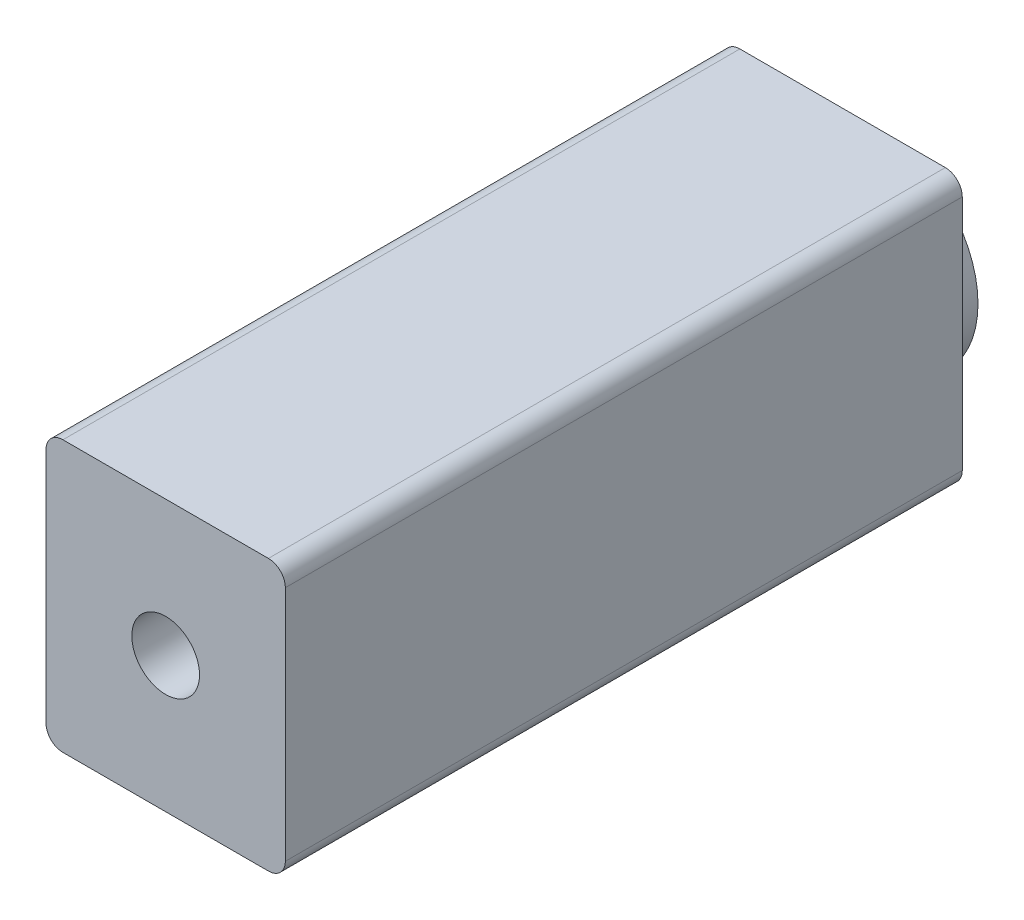
ISO-10303-21;
HEADER;
FILE_DESCRIPTION(('STEP AP214'),'2;1');
FILE_NAME('part.step','',(''),(''),'','','');
FILE_SCHEMA(('AUTOMOTIVE_DESIGN { 1 0 10303 214 1 1 1 1 }'));
ENDSEC;
DATA;
#1=APPLICATION_CONTEXT('core data for automotive mechanical design processes');
#2=APPLICATION_PROTOCOL_DEFINITION('international standard','automotive_design',2000,#1);
#3=PRODUCT_CONTEXT('',#1,'mechanical');
#4=PRODUCT('Part','Part','',(#3));
#5=PRODUCT_RELATED_PRODUCT_CATEGORY('part','',(#4));
#6=PRODUCT_DEFINITION_FORMATION('','',#4);
#7=PRODUCT_DEFINITION_CONTEXT('part definition',#1,'design');
#8=PRODUCT_DEFINITION('design','',#6,#7);
#9=PRODUCT_DEFINITION_SHAPE('','',#8);
#10=(LENGTH_UNIT() NAMED_UNIT(*) SI_UNIT(.MILLI.,.METRE.));
#11=(NAMED_UNIT(*) PLANE_ANGLE_UNIT() SI_UNIT($,.RADIAN.));
#12=(NAMED_UNIT(*) SI_UNIT($,.STERADIAN.) SOLID_ANGLE_UNIT());
#13=UNCERTAINTY_MEASURE_WITH_UNIT(LENGTH_MEASURE(1.E-05),#10,'distance_accuracy_value','');
#14=(GEOMETRIC_REPRESENTATION_CONTEXT(3) GLOBAL_UNCERTAINTY_ASSIGNED_CONTEXT((#13)) GLOBAL_UNIT_ASSIGNED_CONTEXT((#10,
#11,#12)) REPRESENTATION_CONTEXT('',''));
#15=CARTESIAN_POINT('',(0.,0.,0.));
#16=DIRECTION('',(0.,0.,1.));
#17=DIRECTION('',(1.,0.,0.));
#18=AXIS2_PLACEMENT_3D('',#15,#16,#17);
#19=CARTESIAN_POINT('',(0.,0.,10.));
#20=DIRECTION('',(0.,0.,-1.));
#21=DIRECTION('',(-1.,0.,0.));
#22=AXIS2_PLACEMENT_3D('',#19,#20,#21);
#23=CYLINDRICAL_SURFACE('',#22,30.);
#24=CARTESIAN_POINT('',(0.,0.,10.));
#25=DIRECTION('',(0.,0.,1.));
#26=DIRECTION('',(1.,0.,0.));
#27=AXIS2_PLACEMENT_3D('',#24,#25,#26);
#28=CIRCLE('',#27,30.);
#29=CARTESIAN_POINT('',(30.,0.,10.));
#30=VERTEX_POINT('',#29);
#31=EDGE_CURVE('E158',#30,#30,#28,.T.);
#32=ORIENTED_EDGE('',*,*,#31,.F.);
#33=EDGE_LOOP('',(#32));
#34=FACE_BOUND('',#33,.T.);
#35=CARTESIAN_POINT('',(0.,0.,0.));
#36=DIRECTION('',(0.,0.,1.));
#37=DIRECTION('',(1.,0.,0.));
#38=AXIS2_PLACEMENT_3D('',#35,#36,#37);
#39=CIRCLE('',#38,30.);
#40=CARTESIAN_POINT('',(30.,0.,0.));
#41=VERTEX_POINT('',#40);
#42=EDGE_CURVE('E225',#41,#41,#39,.T.);
#43=ORIENTED_EDGE('',*,*,#42,.T.);
#44=EDGE_LOOP('',(#43));
#45=FACE_BOUND('',#44,.T.);
#46=ADVANCED_FACE('F38',(#34,#45),#23,.T.);
#47=CARTESIAN_POINT('',(0.,0.,0.));
#48=DIRECTION('',(0.,0.,1.));
#49=DIRECTION('',(1.,0.,0.));
#50=AXIS2_PLACEMENT_3D('',#47,#48,#49);
#51=PLANE('',#50);
#52=ORIENTED_EDGE('',*,*,#42,.F.);
#53=EDGE_LOOP('',(#52));
#54=FACE_BOUND('',#53,.T.);
#55=ADVANCED_FACE('F337',(#54),#51,.F.);
#56=CARTESIAN_POINT('',(-35.3553390593273,-40.0000000000001,210.));
#57=DIRECTION('',(1.,0.,0.));
#58=DIRECTION('',(0.,0.,-1.));
#59=AXIS2_PLACEMENT_3D('',#56,#57,#58);
#60=PLANE('',#59);
#61=DIRECTION('',(0.,-1.,0.));
#62=VECTOR('',#61,1.);
#63=CARTESIAN_POINT('',(-35.3553390593273,-40.0000000000001,210.));
#64=LINE('',#63,#62);
#65=CARTESIAN_POINT('',(-35.3553390593273,35.0000000000001,210.));
#66=VERTEX_POINT('',#65);
#67=CARTESIAN_POINT('',(-35.3553390593273,-35.0000000000001,210.));
#68=VERTEX_POINT('',#67);
#69=EDGE_CURVE('E199',#66,#68,#64,.T.);
#70=ORIENTED_EDGE('',*,*,#69,.F.);
#71=DIRECTION('',(0.,0.,-1.));
#72=VECTOR('',#71,1.);
#73=CARTESIAN_POINT('',(-35.3553390593273,35.0000000000001,210.));
#74=LINE('',#73,#72);
#75=CARTESIAN_POINT('',(-35.3553390593273,35.0000000000001,10.));
#76=VERTEX_POINT('',#75);
#77=EDGE_CURVE('E189',#66,#76,#74,.T.);
#78=ORIENTED_EDGE('',*,*,#77,.T.);
#79=DIRECTION('',(0.,-1.,0.));
#80=VECTOR('',#79,1.);
#81=CARTESIAN_POINT('',(-35.3553390593273,-40.0000000000001,10.));
#82=LINE('',#81,#80);
#83=CARTESIAN_POINT('',(-35.3553390593273,-35.0000000000001,10.));
#84=VERTEX_POINT('',#83);
#85=EDGE_CURVE('E197',#76,#84,#82,.T.);
#86=ORIENTED_EDGE('',*,*,#85,.T.);
#87=DIRECTION('',(0.,0.,-1.));
#88=VECTOR('',#87,1.);
#89=CARTESIAN_POINT('',(-35.3553390593273,-35.0000000000001,210.));
#90=LINE('',#89,#88);
#91=EDGE_CURVE('E187',#84,#68,#90,.F.);
#92=ORIENTED_EDGE('',*,*,#91,.T.);
#93=EDGE_LOOP('',(#70,#78,#86,#92));
#94=FACE_BOUND('',#93,.T.);
#95=ADVANCED_FACE('F196',(#94),#60,.F.);
#96=CARTESIAN_POINT('',(35.3553390593273,-40.0000000000001,210.));
#97=DIRECTION('',(0.,1.,0.));
#98=DIRECTION('',(0.,0.,1.));
#99=AXIS2_PLACEMENT_3D('',#96,#97,#98);
#100=PLANE('',#99);
#101=DIRECTION('',(1.,0.,0.));
#102=VECTOR('',#101,1.);
#103=CARTESIAN_POINT('',(35.3553390593273,-40.0000000000001,210.));
#104=LINE('',#103,#102);
#105=CARTESIAN_POINT('',(-30.3553390593273,-40.0000000000001,210.));
#106=VERTEX_POINT('',#105);
#107=CARTESIAN_POINT('',(30.3553390593273,-40.0000000000001,210.));
#108=VERTEX_POINT('',#107);
#109=EDGE_CURVE('E439',#106,#108,#104,.T.);
#110=ORIENTED_EDGE('',*,*,#109,.F.);
#111=DIRECTION('',(0.,0.,-1.));
#112=VECTOR('',#111,1.);
#113=CARTESIAN_POINT('',(-30.3553390593273,-40.0000000000001,210.));
#114=LINE('',#113,#112);
#115=CARTESIAN_POINT('',(-30.3553390593273,-40.0000000000001,10.));
#116=VERTEX_POINT('',#115);
#117=EDGE_CURVE('E11',#106,#116,#114,.T.);
#118=ORIENTED_EDGE('',*,*,#117,.T.);
#119=DIRECTION('',(1.,0.,0.));
#120=VECTOR('',#119,1.);
#121=CARTESIAN_POINT('',(35.3553390593273,-40.0000000000001,10.));
#122=LINE('',#121,#120);
#123=CARTESIAN_POINT('',(30.3553390593273,-40.0000000000001,10.));
#124=VERTEX_POINT('',#123);
#125=EDGE_CURVE('E207',#116,#124,#122,.T.);
#126=ORIENTED_EDGE('',*,*,#125,.T.);
#127=DIRECTION('',(0.,0.,-1.));
#128=VECTOR('',#127,1.);
#129=CARTESIAN_POINT('',(30.3553390593273,-40.0000000000001,210.));
#130=LINE('',#129,#128);
#131=EDGE_CURVE('E47',#124,#108,#130,.F.);
#132=ORIENTED_EDGE('',*,*,#131,.T.);
#133=EDGE_LOOP('',(#110,#118,#126,#132));
#134=FACE_BOUND('',#133,.T.);
#135=ADVANCED_FACE('F336',(#134),#100,.F.);
#136=CARTESIAN_POINT('',(35.3553390593273,-40.0000000000001,210.));
#137=DIRECTION('',(-1.,0.,0.));
#138=DIRECTION('',(0.,0.,1.));
#139=AXIS2_PLACEMENT_3D('',#136,#137,#138);
#140=PLANE('',#139);
#141=DIRECTION('',(0.,1.,0.));
#142=VECTOR('',#141,1.);
#143=CARTESIAN_POINT('',(35.3553390593273,-40.0000000000001,10.));
#144=LINE('',#143,#142);
#145=CARTESIAN_POINT('',(35.3553390593273,-35.0000000000001,10.));
#146=VERTEX_POINT('',#145);
#147=CARTESIAN_POINT('',(35.3553390593273,35.0000000000001,10.));
#148=VERTEX_POINT('',#147);
#149=EDGE_CURVE('E210',#146,#148,#144,.T.);
#150=ORIENTED_EDGE('',*,*,#149,.T.);
#151=DIRECTION('',(0.,0.,-1.));
#152=VECTOR('',#151,1.);
#153=CARTESIAN_POINT('',(35.3553390593273,35.0000000000001,210.));
#154=LINE('',#153,#152);
#155=CARTESIAN_POINT('',(35.3553390593273,35.0000000000001,210.));
#156=VERTEX_POINT('',#155);
#157=EDGE_CURVE('E178',#148,#156,#154,.F.);
#158=ORIENTED_EDGE('',*,*,#157,.T.);
#159=DIRECTION('',(0.,1.,0.));
#160=VECTOR('',#159,1.);
#161=CARTESIAN_POINT('',(35.3553390593273,-40.0000000000001,210.));
#162=LINE('',#161,#160);
#163=CARTESIAN_POINT('',(35.3553390593273,-35.0000000000001,210.));
#164=VERTEX_POINT('',#163);
#165=EDGE_CURVE('E440',#164,#156,#162,.T.);
#166=ORIENTED_EDGE('',*,*,#165,.F.);
#167=DIRECTION('',(0.,0.,-1.));
#168=VECTOR('',#167,1.);
#169=CARTESIAN_POINT('',(35.3553390593273,-35.0000000000001,210.));
#170=LINE('',#169,#168);
#171=EDGE_CURVE('E175',#164,#146,#170,.T.);
#172=ORIENTED_EDGE('',*,*,#171,.T.);
#173=EDGE_LOOP('',(#150,#158,#166,#172));
#174=FACE_BOUND('',#173,.T.);
#175=ADVANCED_FACE('F345',(#174),#140,.F.);
#176=CARTESIAN_POINT('',(35.3553390593273,40.0000000000001,210.));
#177=DIRECTION('',(0.,-1.,0.));
#178=DIRECTION('',(0.,0.,-1.));
#179=AXIS2_PLACEMENT_3D('',#176,#177,#178);
#180=PLANE('',#179);
#181=DIRECTION('',(-1.,0.,0.));
#182=VECTOR('',#181,1.);
#183=CARTESIAN_POINT('',(35.3553390593273,40.0000000000001,210.));
#184=LINE('',#183,#182);
#185=CARTESIAN_POINT('',(30.3553390593273,40.0000000000001,210.));
#186=VERTEX_POINT('',#185);
#187=CARTESIAN_POINT('',(-30.3553390593273,40.0000000000001,210.));
#188=VERTEX_POINT('',#187);
#189=EDGE_CURVE('E216',#186,#188,#184,.T.);
#190=ORIENTED_EDGE('',*,*,#189,.F.);
#191=DIRECTION('',(0.,0.,-1.));
#192=VECTOR('',#191,1.);
#193=CARTESIAN_POINT('',(30.3553390593273,40.0000000000001,210.));
#194=LINE('',#193,#192);
#195=CARTESIAN_POINT('',(30.3553390593273,40.0000000000001,10.));
#196=VERTEX_POINT('',#195);
#197=EDGE_CURVE('E163',#186,#196,#194,.T.);
#198=ORIENTED_EDGE('',*,*,#197,.T.);
#199=DIRECTION('',(-1.,0.,0.));
#200=VECTOR('',#199,1.);
#201=CARTESIAN_POINT('',(35.3553390593273,40.0000000000001,10.));
#202=LINE('',#201,#200);
#203=CARTESIAN_POINT('',(-30.3553390593273,40.0000000000001,10.));
#204=VERTEX_POINT('',#203);
#205=EDGE_CURVE('E221',#196,#204,#202,.T.);
#206=ORIENTED_EDGE('',*,*,#205,.T.);
#207=DIRECTION('',(0.,0.,-1.));
#208=VECTOR('',#207,1.);
#209=CARTESIAN_POINT('',(-30.3553390593273,40.0000000000001,210.));
#210=LINE('',#209,#208);
#211=EDGE_CURVE('E161',#204,#188,#210,.F.);
#212=ORIENTED_EDGE('',*,*,#211,.T.);
#213=EDGE_LOOP('',(#190,#198,#206,#212));
#214=FACE_BOUND('',#213,.T.);
#215=ADVANCED_FACE('F352',(#214),#180,.F.);
#216=CARTESIAN_POINT('',(0.,0.,210.));
#217=DIRECTION('',(0.,0.,1.));
#218=DIRECTION('',(1.,0.,0.));
#219=AXIS2_PLACEMENT_3D('',#216,#217,#218);
#220=PLANE('',#219);
#221=CARTESIAN_POINT('',(0.,0.,210.));
#222=DIRECTION('',(0.,0.,1.));
#223=DIRECTION('',(1.,0.,0.));
#224=AXIS2_PLACEMENT_3D('',#221,#222,#223);
#225=CIRCLE('',#224,10.);
#226=CARTESIAN_POINT('',(10.,0.,210.));
#227=VERTEX_POINT('',#226);
#228=EDGE_CURVE('E213',#227,#227,#225,.T.);
#229=ORIENTED_EDGE('',*,*,#228,.F.);
#230=EDGE_LOOP('',(#229));
#231=FACE_BOUND('',#230,.T.);
#232=ORIENTED_EDGE('',*,*,#165,.T.);
#233=CARTESIAN_POINT('',(30.3553390593273,35.0000000000001,210.));
#234=DIRECTION('',(0.,0.,1.));
#235=DIRECTION('',(1.,0.,0.));
#236=AXIS2_PLACEMENT_3D('',#233,#234,#235);
#237=CIRCLE('',#236,5.);
#238=EDGE_CURVE('E185',#156,#186,#237,.T.);
#239=ORIENTED_EDGE('',*,*,#238,.T.);
#240=ORIENTED_EDGE('',*,*,#189,.T.);
#241=CARTESIAN_POINT('',(-30.3553390593273,35.0000000000001,210.));
#242=DIRECTION('',(0.,0.,1.));
#243=DIRECTION('',(1.,0.,0.));
#244=AXIS2_PLACEMENT_3D('',#241,#242,#243);
#245=CIRCLE('',#244,5.);
#246=EDGE_CURVE('E183',#188,#66,#245,.T.);
#247=ORIENTED_EDGE('',*,*,#246,.T.);
#248=ORIENTED_EDGE('',*,*,#69,.T.);
#249=CARTESIAN_POINT('',(-30.3553390593273,-35.0000000000001,210.));
#250=DIRECTION('',(0.,0.,1.));
#251=DIRECTION('',(1.,0.,0.));
#252=AXIS2_PLACEMENT_3D('',#249,#250,#251);
#253=CIRCLE('',#252,5.);
#254=EDGE_CURVE('E60',#68,#106,#253,.T.);
#255=ORIENTED_EDGE('',*,*,#254,.T.);
#256=ORIENTED_EDGE('',*,*,#109,.T.);
#257=CARTESIAN_POINT('',(30.3553390593273,-35.0000000000001,210.));
#258=DIRECTION('',(0.,0.,1.));
#259=DIRECTION('',(1.,0.,0.));
#260=AXIS2_PLACEMENT_3D('',#257,#258,#259);
#261=CIRCLE('',#260,5.);
#262=EDGE_CURVE('E180',#108,#164,#261,.T.);
#263=ORIENTED_EDGE('',*,*,#262,.T.);
#264=EDGE_LOOP('',(#232,#239,#240,#247,#248,#255,#256,#263));
#265=FACE_BOUND('',#264,.T.);
#266=ADVANCED_FACE('F360',(#231,#265),#220,.T.);
#267=CARTESIAN_POINT('',(0.,0.,10.));
#268=DIRECTION('',(0.,0.,1.));
#269=DIRECTION('',(1.,0.,0.));
#270=AXIS2_PLACEMENT_3D('',#267,#268,#269);
#271=PLANE('',#270);
#272=ORIENTED_EDGE('',*,*,#31,.T.);
#273=EDGE_LOOP('',(#272));
#274=FACE_BOUND('',#273,.T.);
#275=ORIENTED_EDGE('',*,*,#205,.F.);
#276=CARTESIAN_POINT('',(30.3553390593273,35.0000000000001,10.));
#277=DIRECTION('',(0.,0.,1.));
#278=DIRECTION('',(1.,0.,0.));
#279=AXIS2_PLACEMENT_3D('',#276,#277,#278);
#280=CIRCLE('',#279,5.);
#281=EDGE_CURVE('E173',#196,#148,#280,.F.);
#282=ORIENTED_EDGE('',*,*,#281,.T.);
#283=ORIENTED_EDGE('',*,*,#149,.F.);
#284=CARTESIAN_POINT('',(30.3553390593273,-35.0000000000001,10.));
#285=DIRECTION('',(0.,0.,1.));
#286=DIRECTION('',(1.,0.,0.));
#287=AXIS2_PLACEMENT_3D('',#284,#285,#286);
#288=CIRCLE('',#287,5.);
#289=EDGE_CURVE('E167',#146,#124,#288,.F.);
#290=ORIENTED_EDGE('',*,*,#289,.T.);
#291=ORIENTED_EDGE('',*,*,#125,.F.);
#292=CARTESIAN_POINT('',(-30.3553390593273,-35.0000000000001,10.));
#293=DIRECTION('',(0.,0.,1.));
#294=DIRECTION('',(1.,0.,0.));
#295=AXIS2_PLACEMENT_3D('',#292,#293,#294);
#296=CIRCLE('',#295,5.);
#297=EDGE_CURVE('E169',#116,#84,#296,.F.);
#298=ORIENTED_EDGE('',*,*,#297,.T.);
#299=ORIENTED_EDGE('',*,*,#85,.F.);
#300=CARTESIAN_POINT('',(-30.3553390593273,35.0000000000001,10.));
#301=DIRECTION('',(0.,0.,1.));
#302=DIRECTION('',(1.,0.,0.));
#303=AXIS2_PLACEMENT_3D('',#300,#301,#302);
#304=CIRCLE('',#303,5.);
#305=EDGE_CURVE('E171',#76,#204,#304,.F.);
#306=ORIENTED_EDGE('',*,*,#305,.T.);
#307=EDGE_LOOP('',(#275,#282,#283,#290,#291,#298,#299,#306));
#308=FACE_BOUND('',#307,.T.);
#309=ADVANCED_FACE('F204',(#274,#308),#271,.F.);
#310=CARTESIAN_POINT('',(0.,0.,60.));
#311=DIRECTION('',(0.,0.,1.));
#312=DIRECTION('',(1.,0.,0.));
#313=AXIS2_PLACEMENT_3D('',#310,#311,#312);
#314=CYLINDRICAL_SURFACE('',#313,10.);
#315=CARTESIAN_POINT('',(0.,0.,60.));
#316=DIRECTION('',(0.,0.,1.));
#317=DIRECTION('',(1.,0.,0.));
#318=AXIS2_PLACEMENT_3D('',#315,#316,#317);
#319=CIRCLE('',#318,10.);
#320=CARTESIAN_POINT('',(10.,0.,60.));
#321=VERTEX_POINT('',#320);
#322=EDGE_CURVE('E208',#321,#321,#319,.T.);
#323=ORIENTED_EDGE('',*,*,#322,.F.);
#324=EDGE_LOOP('',(#323));
#325=FACE_BOUND('',#324,.T.);
#326=ORIENTED_EDGE('',*,*,#228,.T.);
#327=EDGE_LOOP('',(#326));
#328=FACE_BOUND('',#327,.T.);
#329=ADVANCED_FACE('F375',(#325,#328),#314,.F.);
#330=CARTESIAN_POINT('',(0.,0.,60.));
#331=DIRECTION('',(0.,0.,1.));
#332=DIRECTION('',(1.,0.,0.));
#333=AXIS2_PLACEMENT_3D('',#330,#331,#332);
#334=PLANE('',#333);
#335=ORIENTED_EDGE('',*,*,#322,.T.);
#336=EDGE_LOOP('',(#335));
#337=FACE_BOUND('',#336,.T.);
#338=ADVANCED_FACE('F385',(#337),#334,.T.);
#339=CARTESIAN_POINT('',(30.3553390593273,35.0000000000001,210.));
#340=DIRECTION('',(0.,0.,-1.));
#341=DIRECTION('',(-1.,0.,0.));
#342=AXIS2_PLACEMENT_3D('',#339,#340,#341);
#343=CYLINDRICAL_SURFACE('',#342,5.);
#344=ORIENTED_EDGE('',*,*,#238,.F.);
#345=ORIENTED_EDGE('',*,*,#157,.F.);
#346=ORIENTED_EDGE('',*,*,#281,.F.);
#347=ORIENTED_EDGE('',*,*,#197,.F.);
#348=EDGE_LOOP('',(#344,#345,#346,#347));
#349=FACE_BOUND('',#348,.T.);
#350=ADVANCED_FACE('F381',(#349),#343,.T.);
#351=CARTESIAN_POINT('',(-30.3553390593273,35.0000000000001,210.));
#352=DIRECTION('',(0.,0.,-1.));
#353=DIRECTION('',(-1.,0.,0.));
#354=AXIS2_PLACEMENT_3D('',#351,#352,#353);
#355=CYLINDRICAL_SURFACE('',#354,5.);
#356=ORIENTED_EDGE('',*,*,#246,.F.);
#357=ORIENTED_EDGE('',*,*,#211,.F.);
#358=ORIENTED_EDGE('',*,*,#305,.F.);
#359=ORIENTED_EDGE('',*,*,#77,.F.);
#360=EDGE_LOOP('',(#356,#357,#358,#359));
#361=FACE_BOUND('',#360,.T.);
#362=ADVANCED_FACE('F384',(#361),#355,.T.);
#363=CARTESIAN_POINT('',(-30.3553390593273,-35.0000000000001,210.));
#364=DIRECTION('',(0.,0.,-1.));
#365=DIRECTION('',(-1.,0.,0.));
#366=AXIS2_PLACEMENT_3D('',#363,#364,#365);
#367=CYLINDRICAL_SURFACE('',#366,5.);
#368=ORIENTED_EDGE('',*,*,#254,.F.);
#369=ORIENTED_EDGE('',*,*,#91,.F.);
#370=ORIENTED_EDGE('',*,*,#297,.F.);
#371=ORIENTED_EDGE('',*,*,#117,.F.);
#372=EDGE_LOOP('',(#368,#369,#370,#371));
#373=FACE_BOUND('',#372,.T.);
#374=ADVANCED_FACE('F395',(#373),#367,.T.);
#375=CARTESIAN_POINT('',(30.3553390593273,-35.0000000000001,210.));
#376=DIRECTION('',(0.,0.,-1.));
#377=DIRECTION('',(-1.,0.,0.));
#378=AXIS2_PLACEMENT_3D('',#375,#376,#377);
#379=CYLINDRICAL_SURFACE('',#378,5.);
#380=ORIENTED_EDGE('',*,*,#262,.F.);
#381=ORIENTED_EDGE('',*,*,#131,.F.);
#382=ORIENTED_EDGE('',*,*,#289,.F.);
#383=ORIENTED_EDGE('',*,*,#171,.F.);
#384=EDGE_LOOP('',(#380,#381,#382,#383));
#385=FACE_BOUND('',#384,.T.);
#386=ADVANCED_FACE('F40',(#385),#379,.T.);
#387=CLOSED_SHELL('',(#46,#55,#95,#135,#175,#215,#266,#309,#329,#338,#350,#362,#374,#386));
#388=CARTESIAN_POINT('',(0.,0.,10.));
#389=DIRECTION('',(0.,0.,-1.));
#390=DIRECTION('',(-1.,0.,0.));
#391=AXIS2_PLACEMENT_3D('',#388,#389,#390);
#392=CYLINDRICAL_SURFACE('',#391,28.);
#393=CARTESIAN_POINT('',(0.,0.,12.));
#394=DIRECTION('',(0.,0.,1.));
#395=DIRECTION('',(1.,0.,0.));
#396=AXIS2_PLACEMENT_3D('',#393,#394,#395);
#397=CIRCLE('',#396,28.);
#398=CARTESIAN_POINT('',(28.,0.,12.));
#399=VERTEX_POINT('',#398);
#400=EDGE_CURVE('E233',#399,#399,#397,.T.);
#401=ORIENTED_EDGE('',*,*,#400,.T.);
#402=EDGE_LOOP('',(#401));
#403=FACE_BOUND('',#402,.T.);
#404=CARTESIAN_POINT('',(0.,0.,2.));
#405=DIRECTION('',(0.,0.,1.));
#406=DIRECTION('',(1.,0.,0.));
#407=AXIS2_PLACEMENT_3D('',#404,#405,#406);
#408=CIRCLE('',#407,28.);
#409=CARTESIAN_POINT('',(28.,0.,2.));
#410=VERTEX_POINT('',#409);
#411=EDGE_CURVE('E154',#410,#410,#408,.T.);
#412=ORIENTED_EDGE('',*,*,#411,.F.);
#413=EDGE_LOOP('',(#412));
#414=FACE_BOUND('',#413,.T.);
#415=ADVANCED_FACE('F269',(#403,#414),#392,.F.);
#416=CARTESIAN_POINT('',(0.,0.,2.));
#417=DIRECTION('',(0.,0.,1.));
#418=DIRECTION('',(1.,0.,0.));
#419=AXIS2_PLACEMENT_3D('',#416,#417,#418);
#420=PLANE('',#419);
#421=ORIENTED_EDGE('',*,*,#411,.T.);
#422=EDGE_LOOP('',(#421));
#423=FACE_BOUND('',#422,.T.);
#424=ADVANCED_FACE('F271',(#423),#420,.T.);
#425=CARTESIAN_POINT('',(-33.3553390593273,-40.0000000000001,210.));
#426=DIRECTION('',(1.,0.,0.));
#427=DIRECTION('',(0.,0.,-1.));
#428=AXIS2_PLACEMENT_3D('',#425,#426,#427);
#429=PLANE('',#428);
#430=DIRECTION('',(0.,-1.,0.));
#431=VECTOR('',#430,1.);
#432=CARTESIAN_POINT('',(-33.3553390593273,-40.0000000000001,12.));
#433=LINE('',#432,#431);
#434=CARTESIAN_POINT('',(-33.3553390593273,38.0000000000001,12.));
#435=VERTEX_POINT('',#434);
#436=CARTESIAN_POINT('',(-33.3553390593273,-38.0000000000001,12.));
#437=VERTEX_POINT('',#436);
#438=EDGE_CURVE('E145',#435,#437,#433,.T.);
#439=ORIENTED_EDGE('',*,*,#438,.F.);
#440=DIRECTION('',(0.,0.,-1.));
#441=VECTOR('',#440,1.);
#442=CARTESIAN_POINT('',(-33.3553390593273,38.0000000000001,210.));
#443=LINE('',#442,#441);
#444=CARTESIAN_POINT('',(-33.3553390593273,38.0000000000001,208.));
#445=VERTEX_POINT('',#444);
#446=EDGE_CURVE('E138',#445,#435,#443,.T.);
#447=ORIENTED_EDGE('',*,*,#446,.F.);
#448=DIRECTION('',(0.,-1.,0.));
#449=VECTOR('',#448,1.);
#450=CARTESIAN_POINT('',(-33.3553390593273,-40.0000000000001,208.));
#451=LINE('',#450,#449);
#452=CARTESIAN_POINT('',(-33.3553390593273,-38.0000000000001,208.));
#453=VERTEX_POINT('',#452);
#454=EDGE_CURVE('E147',#445,#453,#451,.T.);
#455=ORIENTED_EDGE('',*,*,#454,.T.);
#456=DIRECTION('',(0.,0.,-1.));
#457=VECTOR('',#456,1.);
#458=CARTESIAN_POINT('',(-33.3553390593274,-38.0000000000001,210.));
#459=LINE('',#458,#457);
#460=EDGE_CURVE('E132',#453,#437,#459,.T.);
#461=ORIENTED_EDGE('',*,*,#460,.T.);
#462=EDGE_LOOP('',(#439,#447,#455,#461));
#463=FACE_BOUND('',#462,.T.);
#464=ADVANCED_FACE('F143',(#463),#429,.T.);
#465=CARTESIAN_POINT('',(35.3553390593273,-38.0000000000001,210.));
#466=DIRECTION('',(0.,1.,0.));
#467=DIRECTION('',(0.,0.,1.));
#468=AXIS2_PLACEMENT_3D('',#465,#466,#467);
#469=PLANE('',#468);
#470=DIRECTION('',(1.,0.,0.));
#471=VECTOR('',#470,1.);
#472=CARTESIAN_POINT('',(35.3553390593273,-38.0000000000001,12.));
#473=LINE('',#472,#471);
#474=CARTESIAN_POINT('',(33.3553390593273,-38.0000000000001,12.));
#475=VERTEX_POINT('',#474);
#476=EDGE_CURVE('E129',#437,#475,#473,.T.);
#477=ORIENTED_EDGE('',*,*,#476,.F.);
#478=ORIENTED_EDGE('',*,*,#460,.F.);
#479=DIRECTION('',(1.,0.,0.));
#480=VECTOR('',#479,1.);
#481=CARTESIAN_POINT('',(35.3553390593273,-38.0000000000001,208.));
#482=LINE('',#481,#480);
#483=CARTESIAN_POINT('',(33.3553390593273,-38.0000000000001,208.));
#484=VERTEX_POINT('',#483);
#485=EDGE_CURVE('E240',#453,#484,#482,.T.);
#486=ORIENTED_EDGE('',*,*,#485,.T.);
#487=DIRECTION('',(0.,0.,-1.));
#488=VECTOR('',#487,1.);
#489=CARTESIAN_POINT('',(33.3553390593273,-38.0000000000001,210.));
#490=LINE('',#489,#488);
#491=EDGE_CURVE('E134',#484,#475,#490,.T.);
#492=ORIENTED_EDGE('',*,*,#491,.T.);
#493=EDGE_LOOP('',(#477,#478,#486,#492));
#494=FACE_BOUND('',#493,.T.);
#495=ADVANCED_FACE('F131',(#494),#469,.T.);
#496=CARTESIAN_POINT('',(33.3553390593273,-40.0000000000001,210.));
#497=DIRECTION('',(-1.,0.,0.));
#498=DIRECTION('',(0.,0.,1.));
#499=AXIS2_PLACEMENT_3D('',#496,#497,#498);
#500=PLANE('',#499);
#501=DIRECTION('',(0.,1.,0.));
#502=VECTOR('',#501,1.);
#503=CARTESIAN_POINT('',(33.3553390593273,-40.0000000000001,12.));
#504=LINE('',#503,#502);
#505=CARTESIAN_POINT('',(33.3553390593273,38.0000000000001,12.));
#506=VERTEX_POINT('',#505);
#507=EDGE_CURVE('E148',#475,#506,#504,.T.);
#508=ORIENTED_EDGE('',*,*,#507,.F.);
#509=ORIENTED_EDGE('',*,*,#491,.F.);
#510=DIRECTION('',(0.,1.,0.));
#511=VECTOR('',#510,1.);
#512=CARTESIAN_POINT('',(33.3553390593273,-40.0000000000001,208.));
#513=LINE('',#512,#511);
#514=CARTESIAN_POINT('',(33.3553390593273,38.0000000000001,208.));
#515=VERTEX_POINT('',#514);
#516=EDGE_CURVE('E238',#484,#515,#513,.T.);
#517=ORIENTED_EDGE('',*,*,#516,.T.);
#518=DIRECTION('',(0.,0.,-1.));
#519=VECTOR('',#518,1.);
#520=CARTESIAN_POINT('',(33.3553390593273,38.0000000000001,210.));
#521=LINE('',#520,#519);
#522=EDGE_CURVE('E243',#515,#506,#521,.T.);
#523=ORIENTED_EDGE('',*,*,#522,.T.);
#524=EDGE_LOOP('',(#508,#509,#517,#523));
#525=FACE_BOUND('',#524,.T.);
#526=ADVANCED_FACE('F250',(#525),#500,.T.);
#527=CARTESIAN_POINT('',(35.3553390593273,38.0000000000001,210.));
#528=DIRECTION('',(0.,-1.,0.));
#529=DIRECTION('',(0.,0.,-1.));
#530=AXIS2_PLACEMENT_3D('',#527,#528,#529);
#531=PLANE('',#530);
#532=DIRECTION('',(-1.,0.,0.));
#533=VECTOR('',#532,1.);
#534=CARTESIAN_POINT('',(35.3553390593273,38.0000000000001,12.));
#535=LINE('',#534,#533);
#536=EDGE_CURVE('E152',#506,#435,#535,.T.);
#537=ORIENTED_EDGE('',*,*,#536,.F.);
#538=ORIENTED_EDGE('',*,*,#522,.F.);
#539=DIRECTION('',(-1.,0.,0.));
#540=VECTOR('',#539,1.);
#541=CARTESIAN_POINT('',(35.3553390593273,38.0000000000001,208.));
#542=LINE('',#541,#540);
#543=EDGE_CURVE('E236',#515,#445,#542,.T.);
#544=ORIENTED_EDGE('',*,*,#543,.T.);
#545=ORIENTED_EDGE('',*,*,#446,.T.);
#546=EDGE_LOOP('',(#537,#538,#544,#545));
#547=FACE_BOUND('',#546,.T.);
#548=ADVANCED_FACE('F254',(#547),#531,.T.);
#549=CARTESIAN_POINT('',(0.,0.,208.));
#550=DIRECTION('',(0.,0.,1.));
#551=DIRECTION('',(1.,0.,0.));
#552=AXIS2_PLACEMENT_3D('',#549,#550,#551);
#553=PLANE('',#552);
#554=CARTESIAN_POINT('',(0.,0.,208.));
#555=DIRECTION('',(0.,0.,1.));
#556=DIRECTION('',(1.,0.,0.));
#557=AXIS2_PLACEMENT_3D('',#554,#555,#556);
#558=CIRCLE('',#557,12.);
#559=CARTESIAN_POINT('',(12.,0.,208.));
#560=VERTEX_POINT('',#559);
#561=EDGE_CURVE('E230',#560,#560,#558,.T.);
#562=ORIENTED_EDGE('',*,*,#561,.T.);
#563=EDGE_LOOP('',(#562));
#564=FACE_BOUND('',#563,.T.);
#565=ORIENTED_EDGE('',*,*,#454,.F.);
#566=ORIENTED_EDGE('',*,*,#543,.F.);
#567=ORIENTED_EDGE('',*,*,#516,.F.);
#568=ORIENTED_EDGE('',*,*,#485,.F.);
#569=EDGE_LOOP('',(#565,#566,#567,#568));
#570=FACE_BOUND('',#569,.T.);
#571=ADVANCED_FACE('F256',(#564,#570),#553,.F.);
#572=CARTESIAN_POINT('',(0.,0.,12.));
#573=DIRECTION('',(0.,0.,1.));
#574=DIRECTION('',(1.,0.,0.));
#575=AXIS2_PLACEMENT_3D('',#572,#573,#574);
#576=PLANE('',#575);
#577=ORIENTED_EDGE('',*,*,#400,.F.);
#578=EDGE_LOOP('',(#577));
#579=FACE_BOUND('',#578,.T.);
#580=ORIENTED_EDGE('',*,*,#438,.T.);
#581=ORIENTED_EDGE('',*,*,#476,.T.);
#582=ORIENTED_EDGE('',*,*,#507,.T.);
#583=ORIENTED_EDGE('',*,*,#536,.T.);
#584=EDGE_LOOP('',(#580,#581,#582,#583));
#585=FACE_BOUND('',#584,.T.);
#586=ADVANCED_FACE('F150',(#579,#585),#576,.T.);
#587=CARTESIAN_POINT('',(0.,0.,60.));
#588=DIRECTION('',(0.,0.,1.));
#589=DIRECTION('',(1.,0.,0.));
#590=AXIS2_PLACEMENT_3D('',#587,#588,#589);
#591=CYLINDRICAL_SURFACE('',#590,12.);
#592=CARTESIAN_POINT('',(0.,0.,58.));
#593=DIRECTION('',(0.,0.,1.));
#594=DIRECTION('',(1.,0.,0.));
#595=AXIS2_PLACEMENT_3D('',#592,#593,#594);
#596=CIRCLE('',#595,12.);
#597=CARTESIAN_POINT('',(12.,0.,58.));
#598=VERTEX_POINT('',#597);
#599=EDGE_CURVE('E164',#598,#598,#596,.T.);
#600=ORIENTED_EDGE('',*,*,#599,.T.);
#601=EDGE_LOOP('',(#600));
#602=FACE_BOUND('',#601,.T.);
#603=ORIENTED_EDGE('',*,*,#561,.F.);
#604=EDGE_LOOP('',(#603));
#605=FACE_BOUND('',#604,.T.);
#606=ADVANCED_FACE('F265',(#602,#605),#591,.T.);
#607=CARTESIAN_POINT('',(0.,0.,58.));
#608=DIRECTION('',(0.,0.,1.));
#609=DIRECTION('',(1.,0.,0.));
#610=AXIS2_PLACEMENT_3D('',#607,#608,#609);
#611=PLANE('',#610);
#612=ORIENTED_EDGE('',*,*,#599,.F.);
#613=EDGE_LOOP('',(#612));
#614=FACE_BOUND('',#613,.T.);
#615=ADVANCED_FACE('F316',(#614),#611,.F.);
#616=CLOSED_SHELL('',(#415,#424,#464,#495,#526,#548,#571,#586,#606,#615));
#617=ORIENTED_CLOSED_SHELL('',*,#616,.T.);
#618=BREP_WITH_VOIDS('B2',#387,(#617));
#619=ADVANCED_BREP_SHAPE_REPRESENTATION('',(#18,#618),#14);
#620=SHAPE_DEFINITION_REPRESENTATION(#9,#619);
ENDSEC;
END-ISO-10303-21;
